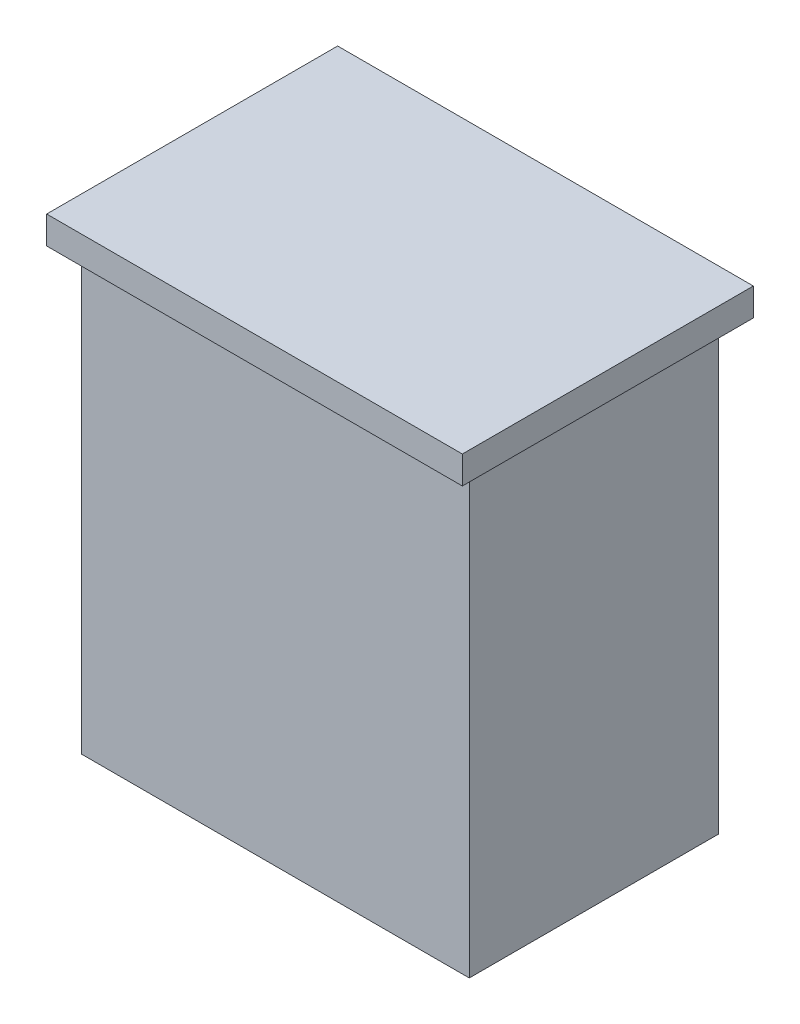
ISO-10303-21;
HEADER;
FILE_DESCRIPTION(('STEP AP214'),'2;1');
FILE_NAME('part.step','',(''),(''),'','','');
FILE_SCHEMA(('AUTOMOTIVE_DESIGN { 1 0 10303 214 1 1 1 1 }'));
ENDSEC;
DATA;
#1=APPLICATION_CONTEXT('core data for automotive mechanical design processes');
#2=APPLICATION_PROTOCOL_DEFINITION('international standard','automotive_design',2000,#1);
#3=PRODUCT_CONTEXT('',#1,'mechanical');
#4=PRODUCT('Part','Part','',(#3));
#5=PRODUCT_RELATED_PRODUCT_CATEGORY('part','',(#4));
#6=PRODUCT_DEFINITION_FORMATION('','',#4);
#7=PRODUCT_DEFINITION_CONTEXT('part definition',#1,'design');
#8=PRODUCT_DEFINITION('design','',#6,#7);
#9=PRODUCT_DEFINITION_SHAPE('','',#8);
#10=(LENGTH_UNIT() NAMED_UNIT(*) SI_UNIT(.MILLI.,.METRE.));
#11=(NAMED_UNIT(*) PLANE_ANGLE_UNIT() SI_UNIT($,.RADIAN.));
#12=(NAMED_UNIT(*) SI_UNIT($,.STERADIAN.) SOLID_ANGLE_UNIT());
#13=UNCERTAINTY_MEASURE_WITH_UNIT(LENGTH_MEASURE(1.E-05),#10,'distance_accuracy_value','');
#14=(GEOMETRIC_REPRESENTATION_CONTEXT(3) GLOBAL_UNCERTAINTY_ASSIGNED_CONTEXT((#13)) GLOBAL_UNIT_ASSIGNED_CONTEXT((#10,
#11,#12)) REPRESENTATION_CONTEXT('',''));
#15=CARTESIAN_POINT('',(0.,0.,0.));
#16=DIRECTION('',(0.,0.,1.));
#17=DIRECTION('',(1.,0.,0.));
#18=AXIS2_PLACEMENT_3D('',#15,#16,#17);
#19=CARTESIAN_POINT('',(7.,16.,-4.5));
#20=DIRECTION('',(-1.,0.,0.));
#21=DIRECTION('',(0.,0.,1.));
#22=AXIS2_PLACEMENT_3D('',#19,#20,#21);
#23=PLANE('',#22);
#24=DIRECTION('',(0.,0.,-1.));
#25=VECTOR('',#24,1.);
#26=CARTESIAN_POINT('',(7.,0.,-4.5));
#27=LINE('',#26,#25);
#28=CARTESIAN_POINT('',(7.,0.,4.5));
#29=VERTEX_POINT('',#28);
#30=CARTESIAN_POINT('',(7.,0.,-4.5));
#31=VERTEX_POINT('',#30);
#32=EDGE_CURVE('E133',#29,#31,#27,.T.);
#33=ORIENTED_EDGE('',*,*,#32,.T.);
#34=DIRECTION('',(0.,-1.,0.));
#35=VECTOR('',#34,1.);
#36=CARTESIAN_POINT('',(7.,16.,-4.5));
#37=LINE('',#36,#35);
#38=CARTESIAN_POINT('',(7.,16.,-4.5));
#39=VERTEX_POINT('',#38);
#40=EDGE_CURVE('E11',#39,#31,#37,.T.);
#41=ORIENTED_EDGE('',*,*,#40,.F.);
#42=DIRECTION('',(0.,0.,-1.));
#43=VECTOR('',#42,1.);
#44=CARTESIAN_POINT('',(7.,16.,-4.5));
#45=LINE('',#44,#43);
#46=CARTESIAN_POINT('',(7.,16.,4.5));
#47=VERTEX_POINT('',#46);
#48=EDGE_CURVE('E142',#47,#39,#45,.T.);
#49=ORIENTED_EDGE('',*,*,#48,.F.);
#50=DIRECTION('',(0.,-1.,0.));
#51=VECTOR('',#50,1.);
#52=CARTESIAN_POINT('',(7.,16.,4.5));
#53=LINE('',#52,#51);
#54=EDGE_CURVE('E151',#47,#29,#53,.T.);
#55=ORIENTED_EDGE('',*,*,#54,.T.);
#56=EDGE_LOOP('',(#33,#41,#49,#55));
#57=FACE_BOUND('',#56,.T.);
#58=ADVANCED_FACE('F35',(#57),#23,.F.);
#59=CARTESIAN_POINT('',(-7.,16.,-4.5));
#60=DIRECTION('',(0.,0.,1.));
#61=DIRECTION('',(1.,0.,0.));
#62=AXIS2_PLACEMENT_3D('',#59,#60,#61);
#63=PLANE('',#62);
#64=DIRECTION('',(-1.,0.,0.));
#65=VECTOR('',#64,1.);
#66=CARTESIAN_POINT('',(-7.,0.,-4.5));
#67=LINE('',#66,#65);
#68=CARTESIAN_POINT('',(-7.,0.,-4.5));
#69=VERTEX_POINT('',#68);
#70=EDGE_CURVE('E136',#31,#69,#67,.T.);
#71=ORIENTED_EDGE('',*,*,#70,.T.);
#72=DIRECTION('',(0.,-1.,0.));
#73=VECTOR('',#72,1.);
#74=CARTESIAN_POINT('',(-7.,16.,-4.5));
#75=LINE('',#74,#73);
#76=CARTESIAN_POINT('',(-7.,16.,-4.5));
#77=VERTEX_POINT('',#76);
#78=EDGE_CURVE('E43',#77,#69,#75,.T.);
#79=ORIENTED_EDGE('',*,*,#78,.F.);
#80=DIRECTION('',(-1.,0.,0.));
#81=VECTOR('',#80,1.);
#82=CARTESIAN_POINT('',(-7.,16.,-4.5));
#83=LINE('',#82,#81);
#84=EDGE_CURVE('E77',#39,#77,#83,.T.);
#85=ORIENTED_EDGE('',*,*,#84,.F.);
#86=ORIENTED_EDGE('',*,*,#40,.T.);
#87=EDGE_LOOP('',(#71,#79,#85,#86));
#88=FACE_BOUND('',#87,.T.);
#89=ADVANCED_FACE('F177',(#88),#63,.F.);
#90=CARTESIAN_POINT('',(-7.,16.,-4.5));
#91=DIRECTION('',(1.,0.,0.));
#92=DIRECTION('',(0.,0.,-1.));
#93=AXIS2_PLACEMENT_3D('',#90,#91,#92);
#94=PLANE('',#93);
#95=DIRECTION('',(0.,0.,1.));
#96=VECTOR('',#95,1.);
#97=CARTESIAN_POINT('',(-7.,0.,-4.5));
#98=LINE('',#97,#96);
#99=CARTESIAN_POINT('',(-7.,0.,4.5));
#100=VERTEX_POINT('',#99);
#101=EDGE_CURVE('E67',#69,#100,#98,.T.);
#102=ORIENTED_EDGE('',*,*,#101,.T.);
#103=DIRECTION('',(0.,-1.,0.));
#104=VECTOR('',#103,1.);
#105=CARTESIAN_POINT('',(-7.,16.,4.5));
#106=LINE('',#105,#104);
#107=CARTESIAN_POINT('',(-7.,16.,4.5));
#108=VERTEX_POINT('',#107);
#109=EDGE_CURVE('E51',#108,#100,#106,.T.);
#110=ORIENTED_EDGE('',*,*,#109,.F.);
#111=DIRECTION('',(0.,0.,1.));
#112=VECTOR('',#111,1.);
#113=CARTESIAN_POINT('',(-7.,16.,-4.5));
#114=LINE('',#113,#112);
#115=EDGE_CURVE('E146',#77,#108,#114,.T.);
#116=ORIENTED_EDGE('',*,*,#115,.F.);
#117=ORIENTED_EDGE('',*,*,#78,.T.);
#118=EDGE_LOOP('',(#102,#110,#116,#117));
#119=FACE_BOUND('',#118,.T.);
#120=ADVANCED_FACE('F157',(#119),#94,.F.);
#121=CARTESIAN_POINT('',(-7.,16.,4.5));
#122=DIRECTION('',(0.,0.,-1.));
#123=DIRECTION('',(-1.,0.,0.));
#124=AXIS2_PLACEMENT_3D('',#121,#122,#123);
#125=PLANE('',#124);
#126=DIRECTION('',(1.,0.,0.));
#127=VECTOR('',#126,1.);
#128=CARTESIAN_POINT('',(-7.,0.,4.5));
#129=LINE('',#128,#127);
#130=EDGE_CURVE('E72',#100,#29,#129,.T.);
#131=ORIENTED_EDGE('',*,*,#130,.T.);
#132=ORIENTED_EDGE('',*,*,#54,.F.);
#133=DIRECTION('',(1.,0.,0.));
#134=VECTOR('',#133,1.);
#135=CARTESIAN_POINT('',(-7.,16.,4.5));
#136=LINE('',#135,#134);
#137=EDGE_CURVE('E149',#108,#47,#136,.T.);
#138=ORIENTED_EDGE('',*,*,#137,.F.);
#139=ORIENTED_EDGE('',*,*,#109,.T.);
#140=EDGE_LOOP('',(#131,#132,#138,#139));
#141=FACE_BOUND('',#140,.T.);
#142=ADVANCED_FACE('F162',(#141),#125,.F.);
#143=CARTESIAN_POINT('',(0.,0.,0.));
#144=DIRECTION('',(0.,1.,0.));
#145=DIRECTION('',(0.,0.,1.));
#146=AXIS2_PLACEMENT_3D('',#143,#144,#145);
#147=PLANE('',#146);
#148=ORIENTED_EDGE('',*,*,#32,.F.);
#149=ORIENTED_EDGE('',*,*,#130,.F.);
#150=ORIENTED_EDGE('',*,*,#101,.F.);
#151=ORIENTED_EDGE('',*,*,#70,.F.);
#152=EDGE_LOOP('',(#148,#149,#150,#151));
#153=FACE_BOUND('',#152,.T.);
#154=ADVANCED_FACE('F160',(#153),#147,.F.);
#155=CARTESIAN_POINT('',(0.,16.,0.));
#156=DIRECTION('',(0.,1.,0.));
#157=DIRECTION('',(0.,0.,1.));
#158=AXIS2_PLACEMENT_3D('',#155,#156,#157);
#159=PLANE('',#158);
#160=DIRECTION('',(0.,0.,-1.));
#161=VECTOR('',#160,1.);
#162=CARTESIAN_POINT('',(7.5,16.,-5.25));
#163=LINE('',#162,#161);
#164=CARTESIAN_POINT('',(7.5,16.,5.25));
#165=VERTEX_POINT('',#164);
#166=CARTESIAN_POINT('',(7.5,16.,-5.25));
#167=VERTEX_POINT('',#166);
#168=EDGE_CURVE('E132',#165,#167,#163,.T.);
#169=ORIENTED_EDGE('',*,*,#168,.F.);
#170=DIRECTION('',(1.,0.,0.));
#171=VECTOR('',#170,1.);
#172=CARTESIAN_POINT('',(-7.5,16.,5.25));
#173=LINE('',#172,#171);
#174=CARTESIAN_POINT('',(-7.5,16.,5.25));
#175=VERTEX_POINT('',#174);
#176=EDGE_CURVE('E128',#175,#165,#173,.T.);
#177=ORIENTED_EDGE('',*,*,#176,.F.);
#178=DIRECTION('',(0.,0.,1.));
#179=VECTOR('',#178,1.);
#180=CARTESIAN_POINT('',(-7.5,16.,-5.25));
#181=LINE('',#180,#179);
#182=CARTESIAN_POINT('',(-7.5,16.,-5.25));
#183=VERTEX_POINT('',#182);
#184=EDGE_CURVE('E204',#183,#175,#181,.T.);
#185=ORIENTED_EDGE('',*,*,#184,.F.);
#186=DIRECTION('',(-1.,0.,0.));
#187=VECTOR('',#186,1.);
#188=CARTESIAN_POINT('',(-7.5,16.,-5.25));
#189=LINE('',#188,#187);
#190=EDGE_CURVE('E207',#167,#183,#189,.T.);
#191=ORIENTED_EDGE('',*,*,#190,.F.);
#192=EDGE_LOOP('',(#169,#177,#185,#191));
#193=FACE_BOUND('',#192,.T.);
#194=ORIENTED_EDGE('',*,*,#137,.T.);
#195=ORIENTED_EDGE('',*,*,#48,.T.);
#196=ORIENTED_EDGE('',*,*,#84,.T.);
#197=ORIENTED_EDGE('',*,*,#115,.T.);
#198=EDGE_LOOP('',(#194,#195,#196,#197));
#199=FACE_BOUND('',#198,.T.);
#200=ADVANCED_FACE('F164',(#193,#199),#159,.F.);
#201=CARTESIAN_POINT('',(7.5,17.,-5.25));
#202=DIRECTION('',(-1.,0.,0.));
#203=DIRECTION('',(0.,0.,1.));
#204=AXIS2_PLACEMENT_3D('',#201,#202,#203);
#205=PLANE('',#204);
#206=ORIENTED_EDGE('',*,*,#168,.T.);
#207=DIRECTION('',(0.,-1.,0.));
#208=VECTOR('',#207,1.);
#209=CARTESIAN_POINT('',(7.5,17.,-5.25));
#210=LINE('',#209,#208);
#211=CARTESIAN_POINT('',(7.5,17.,-5.25));
#212=VERTEX_POINT('',#211);
#213=EDGE_CURVE('E112',#212,#167,#210,.T.);
#214=ORIENTED_EDGE('',*,*,#213,.F.);
#215=DIRECTION('',(0.,0.,-1.));
#216=VECTOR('',#215,1.);
#217=CARTESIAN_POINT('',(7.5,17.,-5.25));
#218=LINE('',#217,#216);
#219=CARTESIAN_POINT('',(7.5,17.,5.25));
#220=VERTEX_POINT('',#219);
#221=EDGE_CURVE('E119',#220,#212,#218,.T.);
#222=ORIENTED_EDGE('',*,*,#221,.F.);
#223=DIRECTION('',(0.,-1.,0.));
#224=VECTOR('',#223,1.);
#225=CARTESIAN_POINT('',(7.5,17.,5.25));
#226=LINE('',#225,#224);
#227=EDGE_CURVE('E201',#220,#165,#226,.T.);
#228=ORIENTED_EDGE('',*,*,#227,.T.);
#229=EDGE_LOOP('',(#206,#214,#222,#228));
#230=FACE_BOUND('',#229,.T.);
#231=ADVANCED_FACE('F130',(#230),#205,.F.);
#232=CARTESIAN_POINT('',(-7.5,17.,-5.25));
#233=DIRECTION('',(0.,0.,1.));
#234=DIRECTION('',(1.,0.,0.));
#235=AXIS2_PLACEMENT_3D('',#232,#233,#234);
#236=PLANE('',#235);
#237=ORIENTED_EDGE('',*,*,#190,.T.);
#238=DIRECTION('',(0.,-1.,0.));
#239=VECTOR('',#238,1.);
#240=CARTESIAN_POINT('',(-7.5,17.,-5.25));
#241=LINE('',#240,#239);
#242=CARTESIAN_POINT('',(-7.5,17.,-5.25));
#243=VERTEX_POINT('',#242);
#244=EDGE_CURVE('E115',#243,#183,#241,.T.);
#245=ORIENTED_EDGE('',*,*,#244,.F.);
#246=DIRECTION('',(-1.,0.,0.));
#247=VECTOR('',#246,1.);
#248=CARTESIAN_POINT('',(-7.5,17.,-5.25));
#249=LINE('',#248,#247);
#250=EDGE_CURVE('E108',#212,#243,#249,.T.);
#251=ORIENTED_EDGE('',*,*,#250,.F.);
#252=ORIENTED_EDGE('',*,*,#213,.T.);
#253=EDGE_LOOP('',(#237,#245,#251,#252));
#254=FACE_BOUND('',#253,.T.);
#255=ADVANCED_FACE('F110',(#254),#236,.F.);
#256=CARTESIAN_POINT('',(-7.5,17.,-5.25));
#257=DIRECTION('',(1.,0.,0.));
#258=DIRECTION('',(0.,0.,-1.));
#259=AXIS2_PLACEMENT_3D('',#256,#257,#258);
#260=PLANE('',#259);
#261=ORIENTED_EDGE('',*,*,#184,.T.);
#262=DIRECTION('',(0.,-1.,0.));
#263=VECTOR('',#262,1.);
#264=CARTESIAN_POINT('',(-7.5,17.,5.25));
#265=LINE('',#264,#263);
#266=CARTESIAN_POINT('',(-7.5,17.,5.25));
#267=VERTEX_POINT('',#266);
#268=EDGE_CURVE('E138',#267,#175,#265,.T.);
#269=ORIENTED_EDGE('',*,*,#268,.F.);
#270=DIRECTION('',(0.,0.,1.));
#271=VECTOR('',#270,1.);
#272=CARTESIAN_POINT('',(-7.5,17.,-5.25));
#273=LINE('',#272,#271);
#274=EDGE_CURVE('E118',#243,#267,#273,.T.);
#275=ORIENTED_EDGE('',*,*,#274,.F.);
#276=ORIENTED_EDGE('',*,*,#244,.T.);
#277=EDGE_LOOP('',(#261,#269,#275,#276));
#278=FACE_BOUND('',#277,.T.);
#279=ADVANCED_FACE('F190',(#278),#260,.F.);
#280=CARTESIAN_POINT('',(-7.5,17.,5.25));
#281=DIRECTION('',(0.,0.,-1.));
#282=DIRECTION('',(-1.,0.,0.));
#283=AXIS2_PLACEMENT_3D('',#280,#281,#282);
#284=PLANE('',#283);
#285=ORIENTED_EDGE('',*,*,#176,.T.);
#286=ORIENTED_EDGE('',*,*,#227,.F.);
#287=DIRECTION('',(1.,0.,0.));
#288=VECTOR('',#287,1.);
#289=CARTESIAN_POINT('',(-7.5,17.,5.25));
#290=LINE('',#289,#288);
#291=EDGE_CURVE('E124',#267,#220,#290,.T.);
#292=ORIENTED_EDGE('',*,*,#291,.F.);
#293=ORIENTED_EDGE('',*,*,#268,.T.);
#294=EDGE_LOOP('',(#285,#286,#292,#293));
#295=FACE_BOUND('',#294,.T.);
#296=ADVANCED_FACE('F192',(#295),#284,.F.);
#297=CARTESIAN_POINT('',(0.,17.,0.));
#298=DIRECTION('',(0.,1.,0.));
#299=DIRECTION('',(0.,0.,1.));
#300=AXIS2_PLACEMENT_3D('',#297,#298,#299);
#301=PLANE('',#300);
#302=ORIENTED_EDGE('',*,*,#221,.T.);
#303=ORIENTED_EDGE('',*,*,#250,.T.);
#304=ORIENTED_EDGE('',*,*,#274,.T.);
#305=ORIENTED_EDGE('',*,*,#291,.T.);
#306=EDGE_LOOP('',(#302,#303,#304,#305));
#307=FACE_BOUND('',#306,.T.);
#308=ADVANCED_FACE('F122',(#307),#301,.T.);
#309=CLOSED_SHELL('',(#58,#89,#120,#142,#154,#200,#231,#255,#279,#296,#308));
#310=MANIFOLD_SOLID_BREP('B2',#309);
#311=ADVANCED_BREP_SHAPE_REPRESENTATION('',(#18,#310),#14);
#312=SHAPE_DEFINITION_REPRESENTATION(#9,#311);
ENDSEC;
END-ISO-10303-21;
